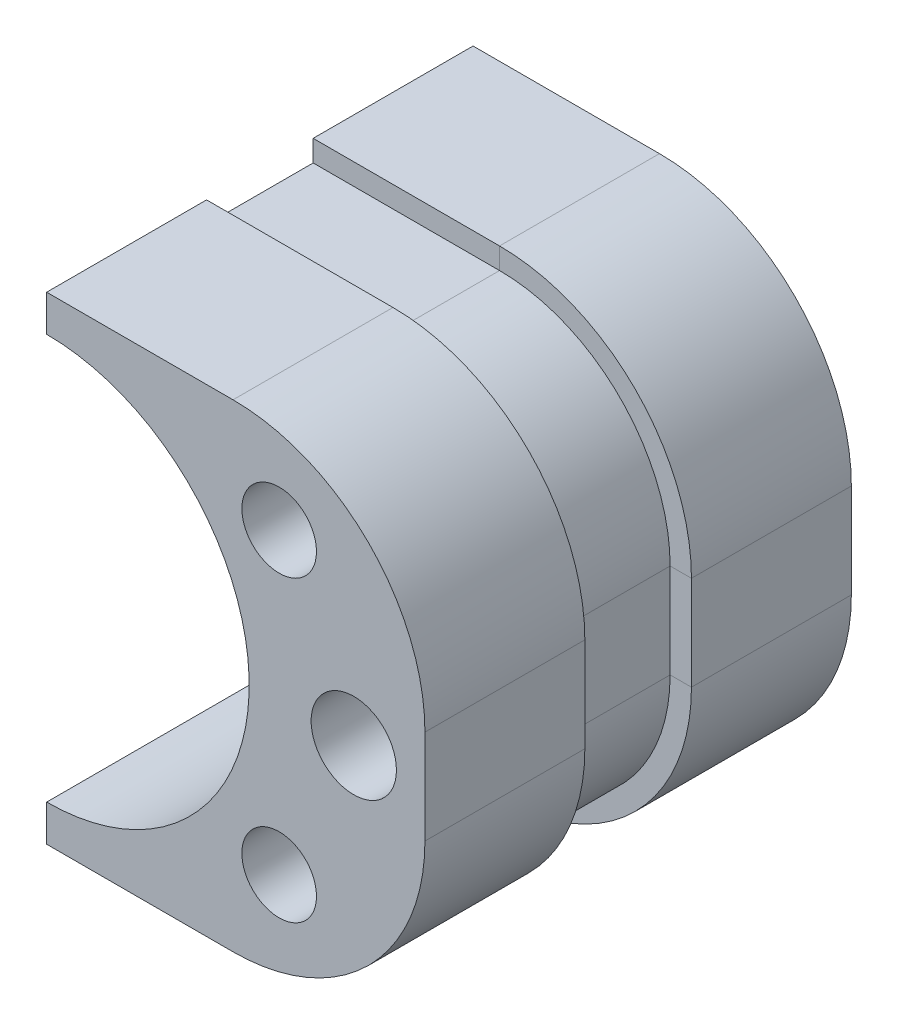
ISO-10303-21;
HEADER;
FILE_DESCRIPTION(('STEP AP214'),'2;1');
FILE_NAME('part.step','',(''),(''),'','','');
FILE_SCHEMA(('AUTOMOTIVE_DESIGN { 1 0 10303 214 1 1 1 1 }'));
ENDSEC;
DATA;
#1=APPLICATION_CONTEXT('core data for automotive mechanical design processes');
#2=APPLICATION_PROTOCOL_DEFINITION('international standard','automotive_design',2000,#1);
#3=PRODUCT_CONTEXT('',#1,'mechanical');
#4=PRODUCT('Part','Part','',(#3));
#5=PRODUCT_RELATED_PRODUCT_CATEGORY('part','',(#4));
#6=PRODUCT_DEFINITION_FORMATION('','',#4);
#7=PRODUCT_DEFINITION_CONTEXT('part definition',#1,'design');
#8=PRODUCT_DEFINITION('design','',#6,#7);
#9=PRODUCT_DEFINITION_SHAPE('','',#8);
#10=(LENGTH_UNIT() NAMED_UNIT(*) SI_UNIT(.MILLI.,.METRE.));
#11=(NAMED_UNIT(*) PLANE_ANGLE_UNIT() SI_UNIT($,.RADIAN.));
#12=(NAMED_UNIT(*) SI_UNIT($,.STERADIAN.) SOLID_ANGLE_UNIT());
#13=UNCERTAINTY_MEASURE_WITH_UNIT(LENGTH_MEASURE(1.E-05),#10,'distance_accuracy_value','');
#14=(GEOMETRIC_REPRESENTATION_CONTEXT(3) GLOBAL_UNCERTAINTY_ASSIGNED_CONTEXT((#13)) GLOBAL_UNIT_ASSIGNED_CONTEXT((#10,
#11,#12)) REPRESENTATION_CONTEXT('',''));
#15=CARTESIAN_POINT('',(0.,0.,0.));
#16=DIRECTION('',(0.,0.,1.));
#17=DIRECTION('',(1.,0.,0.));
#18=AXIS2_PLACEMENT_3D('',#15,#16,#17);
#19=CARTESIAN_POINT('',(21.9231967996094,14.,40.));
#20=DIRECTION('',(0.,0.,-1.));
#21=DIRECTION('',(-1.,0.,0.));
#22=AXIS2_PLACEMENT_3D('',#19,#20,#21);
#23=CYLINDRICAL_SURFACE('',#22,1.39305345916474);
#24=CARTESIAN_POINT('',(21.9231967996094,14.,0.));
#25=DIRECTION('',(0.,0.,1.));
#26=DIRECTION('',(1.,0.,0.));
#27=AXIS2_PLACEMENT_3D('',#24,#25,#26);
#28=CIRCLE('',#27,1.39305345916474);
#29=CARTESIAN_POINT('',(23.3162502587742,14.,0.));
#30=VERTEX_POINT('',#29);
#31=EDGE_CURVE('E150',#30,#30,#28,.T.);
#32=ORIENTED_EDGE('',*,*,#31,.F.);
#33=EDGE_LOOP('',(#32));
#34=FACE_BOUND('',#33,.T.);
#35=CARTESIAN_POINT('',(21.9231967996094,14.,30.));
#36=DIRECTION('',(0.,0.,1.));
#37=DIRECTION('',(1.,0.,0.));
#38=AXIS2_PLACEMENT_3D('',#35,#36,#37);
#39=CIRCLE('',#38,1.39305345916474);
#40=CARTESIAN_POINT('',(23.3162502587742,14.,30.));
#41=VERTEX_POINT('',#40);
#42=EDGE_CURVE('E38',#41,#41,#39,.T.);
#43=ORIENTED_EDGE('',*,*,#42,.T.);
#44=EDGE_LOOP('',(#43));
#45=FACE_BOUND('',#44,.T.);
#46=ADVANCED_FACE('F34',(#34,#45),#23,.F.);
#47=CARTESIAN_POINT('',(21.9231967996094,-14.,40.));
#48=DIRECTION('',(0.,0.,-1.));
#49=DIRECTION('',(-1.,0.,0.));
#50=AXIS2_PLACEMENT_3D('',#47,#48,#49);
#51=CYLINDRICAL_SURFACE('',#50,1.39305345916474);
#52=CARTESIAN_POINT('',(21.9231967996094,-14.,0.));
#53=DIRECTION('',(0.,0.,1.));
#54=DIRECTION('',(1.,0.,0.));
#55=AXIS2_PLACEMENT_3D('',#52,#53,#54);
#56=CIRCLE('',#55,1.39305345916474);
#57=CARTESIAN_POINT('',(23.3162502587742,-14.,0.));
#58=VERTEX_POINT('',#57);
#59=EDGE_CURVE('E177',#58,#58,#56,.F.);
#60=ORIENTED_EDGE('',*,*,#59,.T.);
#61=EDGE_LOOP('',(#60));
#62=FACE_BOUND('',#61,.T.);
#63=CARTESIAN_POINT('',(21.9231967996094,-14.,30.));
#64=DIRECTION('',(0.,0.,1.));
#65=DIRECTION('',(1.,0.,0.));
#66=AXIS2_PLACEMENT_3D('',#63,#64,#65);
#67=CIRCLE('',#66,1.39305345916474);
#68=CARTESIAN_POINT('',(23.3162502587742,-14.,30.));
#69=VERTEX_POINT('',#68);
#70=EDGE_CURVE('E196',#69,#69,#67,.F.);
#71=ORIENTED_EDGE('',*,*,#70,.F.);
#72=EDGE_LOOP('',(#71));
#73=FACE_BOUND('',#72,.T.);
#74=ADVANCED_FACE('F480',(#62,#73),#51,.F.);
#75=CARTESIAN_POINT('',(0.,-22.4238776717364,40.));
#76=DIRECTION('',(0.,1.,0.));
#77=DIRECTION('',(0.,0.,1.));
#78=AXIS2_PLACEMENT_3D('',#75,#76,#77);
#79=PLANE('',#78);
#80=DIRECTION('',(0.,0.,-1.));
#81=VECTOR('',#80,1.);
#82=CARTESIAN_POINT('',(17.5982085730052,-22.4238776717364,40.));
#83=LINE('',#82,#81);
#84=CARTESIAN_POINT('',(17.5982085730052,-22.4238776717364,15.));
#85=VERTEX_POINT('',#84);
#86=CARTESIAN_POINT('',(17.5982085730052,-22.4238776717364,0.));
#87=VERTEX_POINT('',#86);
#88=EDGE_CURVE('E190',#85,#87,#83,.T.);
#89=ORIENTED_EDGE('',*,*,#88,.F.);
#90=DIRECTION('',(1.,0.,0.));
#91=VECTOR('',#90,1.);
#92=CARTESIAN_POINT('',(-0.887437669269544,-22.4238776717364,15.));
#93=LINE('',#92,#91);
#94=CARTESIAN_POINT('',(0.112562330730456,-22.4238776717364,15.));
#95=VERTEX_POINT('',#94);
#96=EDGE_CURVE('E225',#95,#85,#93,.T.);
#97=ORIENTED_EDGE('',*,*,#96,.F.);
#98=DIRECTION('',(0.,0.,-1.));
#99=VECTOR('',#98,1.);
#100=CARTESIAN_POINT('',(0.112562330730456,-22.4238776717364,40.));
#101=LINE('',#100,#99);
#102=CARTESIAN_POINT('',(0.112562330730456,-22.4238776717364,0.));
#103=VERTEX_POINT('',#102);
#104=EDGE_CURVE('E194',#95,#103,#101,.T.);
#105=ORIENTED_EDGE('',*,*,#104,.T.);
#106=DIRECTION('',(1.,0.,0.));
#107=VECTOR('',#106,1.);
#108=CARTESIAN_POINT('',(0.,-22.4238776717364,0.));
#109=LINE('',#108,#107);
#110=EDGE_CURVE('E159',#103,#87,#109,.T.);
#111=ORIENTED_EDGE('',*,*,#110,.T.);
#112=EDGE_LOOP('',(#89,#97,#105,#111));
#113=FACE_BOUND('',#112,.T.);
#114=ADVANCED_FACE('F430',(#113),#79,.F.);
#115=CARTESIAN_POINT('',(17.5982085730052,-4.42387767173636,40.));
#116=DIRECTION('',(0.,0.,-1.));
#117=DIRECTION('',(-1.,0.,0.));
#118=AXIS2_PLACEMENT_3D('',#115,#116,#117);
#119=CYLINDRICAL_SURFACE('',#118,18.);
#120=CARTESIAN_POINT('',(17.5982085730052,-4.42387767173636,15.));
#121=DIRECTION('',(0.,0.,1.));
#122=DIRECTION('',(0.,-1.,0.));
#123=AXIS2_PLACEMENT_3D('',#120,#121,#122);
#124=CIRCLE('',#123,18.);
#125=CARTESIAN_POINT('',(35.5982085730052,-4.42387767173636,15.));
#126=VERTEX_POINT('',#125);
#127=EDGE_CURVE('E250',#85,#126,#124,.T.);
#128=ORIENTED_EDGE('',*,*,#127,.F.);
#129=ORIENTED_EDGE('',*,*,#88,.T.);
#130=CARTESIAN_POINT('',(17.5982085730052,-4.42387767173636,0.));
#131=DIRECTION('',(0.,0.,1.));
#132=DIRECTION('',(1.,0.,0.));
#133=AXIS2_PLACEMENT_3D('',#130,#131,#132);
#134=CIRCLE('',#133,18.);
#135=CARTESIAN_POINT('',(35.5982085730052,-4.42387767173635,0.));
#136=VERTEX_POINT('',#135);
#137=EDGE_CURVE('E162',#136,#87,#134,.F.);
#138=ORIENTED_EDGE('',*,*,#137,.F.);
#139=DIRECTION('',(0.,0.,-1.));
#140=VECTOR('',#139,1.);
#141=CARTESIAN_POINT('',(35.5982085730052,-4.42387767173635,40.));
#142=LINE('',#141,#140);
#143=EDGE_CURVE('E186',#126,#136,#142,.T.);
#144=ORIENTED_EDGE('',*,*,#143,.F.);
#145=EDGE_LOOP('',(#128,#129,#138,#144));
#146=FACE_BOUND('',#145,.T.);
#147=ADVANCED_FACE('F427',(#146),#119,.T.);
#148=CARTESIAN_POINT('',(35.5982085730052,0.,40.));
#149=DIRECTION('',(1.,0.,0.));
#150=DIRECTION('',(0.,0.,-1.));
#151=AXIS2_PLACEMENT_3D('',#148,#149,#150);
#152=PLANE('',#151);
#153=DIRECTION('',(0.,1.,0.));
#154=VECTOR('',#153,1.);
#155=CARTESIAN_POINT('',(35.5982085730052,-4.42387767173636,15.));
#156=LINE('',#155,#154);
#157=CARTESIAN_POINT('',(35.5982085730052,4.42387767173636,15.));
#158=VERTEX_POINT('',#157);
#159=EDGE_CURVE('E261',#126,#158,#156,.T.);
#160=ORIENTED_EDGE('',*,*,#159,.F.);
#161=ORIENTED_EDGE('',*,*,#143,.T.);
#162=DIRECTION('',(0.,-1.,0.));
#163=VECTOR('',#162,1.);
#164=CARTESIAN_POINT('',(35.5982085730052,0.,0.));
#165=LINE('',#164,#163);
#166=CARTESIAN_POINT('',(35.5982085730052,4.42387767173636,0.));
#167=VERTEX_POINT('',#166);
#168=EDGE_CURVE('E165',#167,#136,#165,.T.);
#169=ORIENTED_EDGE('',*,*,#168,.F.);
#170=DIRECTION('',(0.,0.,-1.));
#171=VECTOR('',#170,1.);
#172=CARTESIAN_POINT('',(35.5982085730052,4.42387767173636,40.));
#173=LINE('',#172,#171);
#174=EDGE_CURVE('E126',#158,#167,#173,.T.);
#175=ORIENTED_EDGE('',*,*,#174,.F.);
#176=EDGE_LOOP('',(#160,#161,#169,#175));
#177=FACE_BOUND('',#176,.T.);
#178=ADVANCED_FACE('F439',(#177),#152,.T.);
#179=CARTESIAN_POINT('',(17.5982085730052,4.42387767173636,40.));
#180=DIRECTION('',(0.,0.,-1.));
#181=DIRECTION('',(-1.,0.,0.));
#182=AXIS2_PLACEMENT_3D('',#179,#180,#181);
#183=CYLINDRICAL_SURFACE('',#182,18.);
#184=CARTESIAN_POINT('',(17.5982085730052,4.42387767173636,15.));
#185=DIRECTION('',(0.,0.,1.));
#186=DIRECTION('',(1.,0.,0.));
#187=AXIS2_PLACEMENT_3D('',#184,#185,#186);
#188=CIRCLE('',#187,18.);
#189=CARTESIAN_POINT('',(17.5982085730052,22.4238776717364,15.));
#190=VERTEX_POINT('',#189);
#191=EDGE_CURVE('E151',#158,#190,#188,.T.);
#192=ORIENTED_EDGE('',*,*,#191,.F.);
#193=ORIENTED_EDGE('',*,*,#174,.T.);
#194=CARTESIAN_POINT('',(17.5982085730052,4.42387767173636,0.));
#195=DIRECTION('',(0.,0.,1.));
#196=DIRECTION('',(1.,0.,0.));
#197=AXIS2_PLACEMENT_3D('',#194,#195,#196);
#198=CIRCLE('',#197,18.);
#199=CARTESIAN_POINT('',(17.5982085730052,22.4238776717364,0.));
#200=VERTEX_POINT('',#199);
#201=EDGE_CURVE('E168',#200,#167,#198,.F.);
#202=ORIENTED_EDGE('',*,*,#201,.F.);
#203=DIRECTION('',(0.,0.,-1.));
#204=VECTOR('',#203,1.);
#205=CARTESIAN_POINT('',(17.5982085730052,22.4238776717364,40.));
#206=LINE('',#205,#204);
#207=EDGE_CURVE('E127',#190,#200,#206,.T.);
#208=ORIENTED_EDGE('',*,*,#207,.F.);
#209=EDGE_LOOP('',(#192,#193,#202,#208));
#210=FACE_BOUND('',#209,.T.);
#211=ADVANCED_FACE('F445',(#210),#183,.T.);
#212=CARTESIAN_POINT('',(0.,22.4238776717364,40.));
#213=DIRECTION('',(0.,1.,0.));
#214=DIRECTION('',(0.,0.,1.));
#215=AXIS2_PLACEMENT_3D('',#212,#213,#214);
#216=PLANE('',#215);
#217=DIRECTION('',(-1.,0.,0.));
#218=VECTOR('',#217,1.);
#219=CARTESIAN_POINT('',(17.5982085730052,22.4238776717364,15.));
#220=LINE('',#219,#218);
#221=CARTESIAN_POINT('',(0.112562330730457,22.4238776717364,15.));
#222=VERTEX_POINT('',#221);
#223=EDGE_CURVE('E216',#190,#222,#220,.T.);
#224=ORIENTED_EDGE('',*,*,#223,.F.);
#225=ORIENTED_EDGE('',*,*,#207,.T.);
#226=DIRECTION('',(1.,0.,0.));
#227=VECTOR('',#226,1.);
#228=CARTESIAN_POINT('',(0.,22.4238776717364,0.));
#229=LINE('',#228,#227);
#230=CARTESIAN_POINT('',(0.112562330730456,22.4238776717364,0.));
#231=VERTEX_POINT('',#230);
#232=EDGE_CURVE('E171',#231,#200,#229,.T.);
#233=ORIENTED_EDGE('',*,*,#232,.F.);
#234=DIRECTION('',(0.,0.,-1.));
#235=VECTOR('',#234,1.);
#236=CARTESIAN_POINT('',(0.112562330730456,22.4238776717364,40.));
#237=LINE('',#236,#235);
#238=EDGE_CURVE('E182',#222,#231,#237,.T.);
#239=ORIENTED_EDGE('',*,*,#238,.F.);
#240=EDGE_LOOP('',(#224,#225,#233,#239));
#241=FACE_BOUND('',#240,.T.);
#242=ADVANCED_FACE('F451',(#241),#216,.T.);
#243=CARTESIAN_POINT('',(0.112562330730456,0.,40.));
#244=DIRECTION('',(0.,0.,-1.));
#245=DIRECTION('',(-1.,0.,0.));
#246=AXIS2_PLACEMENT_3D('',#243,#244,#245);
#247=CYLINDRICAL_SURFACE('',#246,19.);
#248=CARTESIAN_POINT('',(0.112562330730456,0.,0.));
#249=DIRECTION('',(0.,0.,1.));
#250=DIRECTION('',(1.,0.,0.));
#251=AXIS2_PLACEMENT_3D('',#248,#249,#250);
#252=CIRCLE('',#251,19.);
#253=CARTESIAN_POINT('',(0.112562330730456,-19.,0.));
#254=VERTEX_POINT('',#253);
#255=CARTESIAN_POINT('',(0.112562330730456,19.,0.));
#256=VERTEX_POINT('',#255);
#257=EDGE_CURVE('E154',#254,#256,#252,.T.);
#258=ORIENTED_EDGE('',*,*,#257,.F.);
#259=DIRECTION('',(0.,0.,-1.));
#260=VECTOR('',#259,1.);
#261=CARTESIAN_POINT('',(0.112562330730456,-19.,40.));
#262=LINE('',#261,#260);
#263=CARTESIAN_POINT('',(0.112562330730456,-19.,40.));
#264=VERTEX_POINT('',#263);
#265=EDGE_CURVE('E11',#264,#254,#262,.T.);
#266=ORIENTED_EDGE('',*,*,#265,.F.);
#267=CARTESIAN_POINT('',(0.112562330730456,0.,40.));
#268=DIRECTION('',(0.,0.,1.));
#269=DIRECTION('',(1.,0.,0.));
#270=AXIS2_PLACEMENT_3D('',#267,#268,#269);
#271=CIRCLE('',#270,19.);
#272=CARTESIAN_POINT('',(0.112562330730456,19.,40.));
#273=VERTEX_POINT('',#272);
#274=EDGE_CURVE('E322',#264,#273,#271,.T.);
#275=ORIENTED_EDGE('',*,*,#274,.T.);
#276=DIRECTION('',(0.,0.,-1.));
#277=VECTOR('',#276,1.);
#278=CARTESIAN_POINT('',(0.112562330730456,19.,40.));
#279=LINE('',#278,#277);
#280=EDGE_CURVE('E60',#273,#256,#279,.T.);
#281=ORIENTED_EDGE('',*,*,#280,.T.);
#282=EDGE_LOOP('',(#258,#266,#275,#281));
#283=FACE_BOUND('',#282,.T.);
#284=ADVANCED_FACE('F490',(#283),#247,.F.);
#285=CARTESIAN_POINT('',(0.112562330730456,0.,40.));
#286=DIRECTION('',(-1.,0.,0.));
#287=DIRECTION('',(0.,0.,1.));
#288=AXIS2_PLACEMENT_3D('',#285,#286,#287);
#289=PLANE('',#288);
#290=DIRECTION('',(0.,1.,0.));
#291=VECTOR('',#290,1.);
#292=CARTESIAN_POINT('',(0.112562330730456,-22.4238776717364,15.));
#293=LINE('',#292,#291);
#294=CARTESIAN_POINT('',(0.112562330730456,-20.4238776717364,15.));
#295=VERTEX_POINT('',#294);
#296=EDGE_CURVE('E198',#95,#295,#293,.T.);
#297=ORIENTED_EDGE('',*,*,#296,.T.);
#298=DIRECTION('',(0.,0.,1.));
#299=VECTOR('',#298,1.);
#300=CARTESIAN_POINT('',(0.112562330730456,-20.4238776717364,15.));
#301=LINE('',#300,#299);
#302=CARTESIAN_POINT('',(0.112562330730456,-20.4238776717364,25.));
#303=VERTEX_POINT('',#302);
#304=EDGE_CURVE('E304',#295,#303,#301,.T.);
#305=ORIENTED_EDGE('',*,*,#304,.T.);
#306=DIRECTION('',(0.,-1.,0.));
#307=VECTOR('',#306,1.);
#308=CARTESIAN_POINT('',(0.112562330730456,-22.4238776717364,25.));
#309=LINE('',#308,#307);
#310=CARTESIAN_POINT('',(0.112562330730456,-22.4238776717364,25.));
#311=VERTEX_POINT('',#310);
#312=EDGE_CURVE('E308',#303,#311,#309,.T.);
#313=ORIENTED_EDGE('',*,*,#312,.T.);
#314=CARTESIAN_POINT('',(0.112562330730456,-22.4238776717364,40.));
#315=VERTEX_POINT('',#314);
#316=EDGE_CURVE('E43',#315,#311,#101,.T.);
#317=ORIENTED_EDGE('',*,*,#316,.F.);
#318=DIRECTION('',(0.,1.,0.));
#319=VECTOR('',#318,1.);
#320=CARTESIAN_POINT('',(0.112562330730456,0.,40.));
#321=LINE('',#320,#319);
#322=EDGE_CURVE('E324',#315,#264,#321,.T.);
#323=ORIENTED_EDGE('',*,*,#322,.T.);
#324=ORIENTED_EDGE('',*,*,#265,.T.);
#325=DIRECTION('',(0.,1.,0.));
#326=VECTOR('',#325,1.);
#327=CARTESIAN_POINT('',(0.112562330730456,0.,0.));
#328=LINE('',#327,#326);
#329=EDGE_CURVE('E156',#103,#254,#328,.T.);
#330=ORIENTED_EDGE('',*,*,#329,.F.);
#331=ORIENTED_EDGE('',*,*,#104,.F.);
#332=EDGE_LOOP('',(#297,#305,#313,#317,#323,#324,#330,#331));
#333=FACE_BOUND('',#332,.T.);
#334=ADVANCED_FACE('F411',(#333),#289,.T.);
#335=ORIENTED_EDGE('',*,*,#316,.T.);
#336=DIRECTION('',(1.,0.,0.));
#337=VECTOR('',#336,1.);
#338=CARTESIAN_POINT('',(-0.887437669269544,-22.4238776717364,25.));
#339=LINE('',#338,#337);
#340=CARTESIAN_POINT('',(17.5982085730052,-22.4238776717364,25.));
#341=VERTEX_POINT('',#340);
#342=EDGE_CURVE('E311',#311,#341,#339,.T.);
#343=ORIENTED_EDGE('',*,*,#342,.T.);
#344=CARTESIAN_POINT('',(17.5982085730052,-22.4238776717364,40.));
#345=VERTEX_POINT('',#344);
#346=EDGE_CURVE('E191',#345,#341,#83,.T.);
#347=ORIENTED_EDGE('',*,*,#346,.F.);
#348=DIRECTION('',(1.,0.,0.));
#349=VECTOR('',#348,1.);
#350=CARTESIAN_POINT('',(0.,-22.4238776717364,40.));
#351=LINE('',#350,#349);
#352=EDGE_CURVE('E327',#315,#345,#351,.T.);
#353=ORIENTED_EDGE('',*,*,#352,.F.);
#354=EDGE_LOOP('',(#335,#343,#347,#353));
#355=FACE_BOUND('',#354,.T.);
#356=ADVANCED_FACE('F406',(#355),#79,.F.);
#357=CARTESIAN_POINT('',(17.5982085730052,-4.42387767173636,25.));
#358=DIRECTION('',(0.,0.,1.));
#359=DIRECTION('',(0.,-1.,0.));
#360=AXIS2_PLACEMENT_3D('',#357,#358,#359);
#361=CIRCLE('',#360,18.);
#362=CARTESIAN_POINT('',(35.5982085730052,-4.42387767173636,25.));
#363=VERTEX_POINT('',#362);
#364=EDGE_CURVE('E275',#341,#363,#361,.T.);
#365=ORIENTED_EDGE('',*,*,#364,.T.);
#366=CARTESIAN_POINT('',(35.5982085730052,-4.42387767173635,40.));
#367=VERTEX_POINT('',#366);
#368=EDGE_CURVE('E187',#367,#363,#142,.T.);
#369=ORIENTED_EDGE('',*,*,#368,.F.);
#370=CARTESIAN_POINT('',(17.5982085730052,-4.42387767173636,40.));
#371=DIRECTION('',(0.,0.,1.));
#372=DIRECTION('',(1.,0.,0.));
#373=AXIS2_PLACEMENT_3D('',#370,#371,#372);
#374=CIRCLE('',#373,18.);
#375=EDGE_CURVE('E329',#367,#345,#374,.F.);
#376=ORIENTED_EDGE('',*,*,#375,.T.);
#377=ORIENTED_EDGE('',*,*,#346,.T.);
#378=EDGE_LOOP('',(#365,#369,#376,#377));
#379=FACE_BOUND('',#378,.T.);
#380=ADVANCED_FACE('F408',(#379),#119,.T.);
#381=DIRECTION('',(0.,1.,0.));
#382=VECTOR('',#381,1.);
#383=CARTESIAN_POINT('',(35.5982085730052,-4.42387767173636,25.));
#384=LINE('',#383,#382);
#385=CARTESIAN_POINT('',(35.5982085730052,4.42387767173636,25.));
#386=VERTEX_POINT('',#385);
#387=EDGE_CURVE('E279',#363,#386,#384,.T.);
#388=ORIENTED_EDGE('',*,*,#387,.T.);
#389=CARTESIAN_POINT('',(35.5982085730052,4.42387767173636,40.));
#390=VERTEX_POINT('',#389);
#391=EDGE_CURVE('E184',#390,#386,#173,.T.);
#392=ORIENTED_EDGE('',*,*,#391,.F.);
#393=DIRECTION('',(0.,-1.,0.));
#394=VECTOR('',#393,1.);
#395=CARTESIAN_POINT('',(35.5982085730052,0.,40.));
#396=LINE('',#395,#394);
#397=EDGE_CURVE('E137',#390,#367,#396,.T.);
#398=ORIENTED_EDGE('',*,*,#397,.T.);
#399=ORIENTED_EDGE('',*,*,#368,.T.);
#400=EDGE_LOOP('',(#388,#392,#398,#399));
#401=FACE_BOUND('',#400,.T.);
#402=ADVANCED_FACE('F332',(#401),#152,.T.);
#403=CARTESIAN_POINT('',(17.5982085730052,4.42387767173636,25.));
#404=DIRECTION('',(0.,0.,1.));
#405=DIRECTION('',(1.,0.,0.));
#406=AXIS2_PLACEMENT_3D('',#403,#404,#405);
#407=CIRCLE('',#406,18.);
#408=CARTESIAN_POINT('',(17.5982085730052,22.4238776717364,25.));
#409=VERTEX_POINT('',#408);
#410=EDGE_CURVE('E122',#386,#409,#407,.T.);
#411=ORIENTED_EDGE('',*,*,#410,.T.);
#412=CARTESIAN_POINT('',(17.5982085730052,22.4238776717364,40.));
#413=VERTEX_POINT('',#412);
#414=EDGE_CURVE('E115',#413,#409,#206,.T.);
#415=ORIENTED_EDGE('',*,*,#414,.F.);
#416=CARTESIAN_POINT('',(17.5982085730052,4.42387767173636,40.));
#417=DIRECTION('',(0.,0.,1.));
#418=DIRECTION('',(1.,0.,0.));
#419=AXIS2_PLACEMENT_3D('',#416,#417,#418);
#420=CIRCLE('',#419,18.);
#421=EDGE_CURVE('E119',#413,#390,#420,.F.);
#422=ORIENTED_EDGE('',*,*,#421,.T.);
#423=ORIENTED_EDGE('',*,*,#391,.T.);
#424=EDGE_LOOP('',(#411,#415,#422,#423));
#425=FACE_BOUND('',#424,.T.);
#426=ADVANCED_FACE('F117',(#425),#183,.T.);
#427=DIRECTION('',(-1.,0.,0.));
#428=VECTOR('',#427,1.);
#429=CARTESIAN_POINT('',(17.5982085730052,22.4238776717364,25.));
#430=LINE('',#429,#428);
#431=CARTESIAN_POINT('',(0.112562330730457,22.4238776717364,25.));
#432=VERTEX_POINT('',#431);
#433=EDGE_CURVE('E229',#409,#432,#430,.T.);
#434=ORIENTED_EDGE('',*,*,#433,.T.);
#435=CARTESIAN_POINT('',(0.112562330730456,22.4238776717364,40.));
#436=VERTEX_POINT('',#435);
#437=EDGE_CURVE('E141',#436,#432,#237,.T.);
#438=ORIENTED_EDGE('',*,*,#437,.F.);
#439=DIRECTION('',(1.,0.,0.));
#440=VECTOR('',#439,1.);
#441=CARTESIAN_POINT('',(0.,22.4238776717364,40.));
#442=LINE('',#441,#440);
#443=EDGE_CURVE('E134',#436,#413,#442,.T.);
#444=ORIENTED_EDGE('',*,*,#443,.T.);
#445=ORIENTED_EDGE('',*,*,#414,.T.);
#446=EDGE_LOOP('',(#434,#438,#444,#445));
#447=FACE_BOUND('',#446,.T.);
#448=ADVANCED_FACE('F139',(#447),#216,.T.);
#449=CARTESIAN_POINT('',(0.112562330730456,0.,40.));
#450=DIRECTION('',(-1.,0.,0.));
#451=DIRECTION('',(0.,0.,1.));
#452=AXIS2_PLACEMENT_3D('',#449,#450,#451);
#453=PLANE('',#452);
#454=DIRECTION('',(0.,1.,0.));
#455=VECTOR('',#454,1.);
#456=CARTESIAN_POINT('',(0.112562330730457,22.4238776717364,15.));
#457=LINE('',#456,#455);
#458=CARTESIAN_POINT('',(0.112562330730457,20.4238776717364,15.));
#459=VERTEX_POINT('',#458);
#460=EDGE_CURVE('E224',#459,#222,#457,.T.);
#461=ORIENTED_EDGE('',*,*,#460,.T.);
#462=ORIENTED_EDGE('',*,*,#238,.T.);
#463=DIRECTION('',(0.,1.,0.));
#464=VECTOR('',#463,1.);
#465=CARTESIAN_POINT('',(0.112562330730456,0.,0.));
#466=LINE('',#465,#464);
#467=EDGE_CURVE('E174',#256,#231,#466,.T.);
#468=ORIENTED_EDGE('',*,*,#467,.F.);
#469=ORIENTED_EDGE('',*,*,#280,.F.);
#470=DIRECTION('',(0.,1.,0.));
#471=VECTOR('',#470,1.);
#472=CARTESIAN_POINT('',(0.112562330730456,0.,40.));
#473=LINE('',#472,#471);
#474=EDGE_CURVE('E142',#273,#436,#473,.T.);
#475=ORIENTED_EDGE('',*,*,#474,.T.);
#476=ORIENTED_EDGE('',*,*,#437,.T.);
#477=DIRECTION('',(0.,-1.,0.));
#478=VECTOR('',#477,1.);
#479=CARTESIAN_POINT('',(0.112562330730457,22.4238776717364,25.));
#480=LINE('',#479,#478);
#481=CARTESIAN_POINT('',(0.112562330730456,20.4238776717364,25.));
#482=VERTEX_POINT('',#481);
#483=EDGE_CURVE('E231',#432,#482,#480,.T.);
#484=ORIENTED_EDGE('',*,*,#483,.T.);
#485=DIRECTION('',(0.,0.,-1.));
#486=VECTOR('',#485,1.);
#487=CARTESIAN_POINT('',(0.112562330730457,20.4238776717364,15.));
#488=LINE('',#487,#486);
#489=EDGE_CURVE('E227',#482,#459,#488,.T.);
#490=ORIENTED_EDGE('',*,*,#489,.T.);
#491=EDGE_LOOP('',(#461,#462,#468,#469,#475,#476,#484,#490));
#492=FACE_BOUND('',#491,.T.);
#493=ADVANCED_FACE('F455',(#492),#453,.T.);
#494=CARTESIAN_POINT('',(28.9231967996094,0.,40.));
#495=DIRECTION('',(0.,0.,-1.));
#496=DIRECTION('',(-1.,0.,0.));
#497=AXIS2_PLACEMENT_3D('',#494,#495,#496);
#498=CYLINDRICAL_SURFACE('',#497,4.00000000000001);
#499=CARTESIAN_POINT('',(28.9231967996094,0.,40.));
#500=DIRECTION('',(0.,0.,1.));
#501=DIRECTION('',(1.,0.,0.));
#502=AXIS2_PLACEMENT_3D('',#499,#500,#501);
#503=CIRCLE('',#502,4.00000000000001);
#504=CARTESIAN_POINT('',(32.9231967996094,0.,40.));
#505=VERTEX_POINT('',#504);
#506=EDGE_CURVE('E180',#505,#505,#503,.T.);
#507=ORIENTED_EDGE('',*,*,#506,.T.);
#508=EDGE_LOOP('',(#507));
#509=FACE_BOUND('',#508,.T.);
#510=CARTESIAN_POINT('',(28.9231967996094,0.,0.));
#511=DIRECTION('',(0.,0.,1.));
#512=DIRECTION('',(1.,0.,0.));
#513=AXIS2_PLACEMENT_3D('',#510,#511,#512);
#514=CIRCLE('',#513,4.00000000000001);
#515=CARTESIAN_POINT('',(32.9231967996094,0.,0.));
#516=VERTEX_POINT('',#515);
#517=EDGE_CURVE('E147',#516,#516,#514,.T.);
#518=ORIENTED_EDGE('',*,*,#517,.F.);
#519=EDGE_LOOP('',(#518));
#520=FACE_BOUND('',#519,.T.);
#521=ADVANCED_FACE('F36',(#509,#520),#498,.F.);
#522=CARTESIAN_POINT('',(0.,0.,40.));
#523=DIRECTION('',(0.,0.,1.));
#524=DIRECTION('',(1.,0.,0.));
#525=AXIS2_PLACEMENT_3D('',#522,#523,#524);
#526=PLANE('',#525);
#527=CARTESIAN_POINT('',(21.9231967996094,14.,40.));
#528=DIRECTION('',(0.,0.,1.));
#529=DIRECTION('',(1.,0.,0.));
#530=AXIS2_PLACEMENT_3D('',#527,#528,#529);
#531=CIRCLE('',#530,3.5);
#532=CARTESIAN_POINT('',(25.4231967996094,14.,40.));
#533=VERTEX_POINT('',#532);
#534=EDGE_CURVE('E213',#533,#533,#531,.T.);
#535=ORIENTED_EDGE('',*,*,#534,.F.);
#536=EDGE_LOOP('',(#535));
#537=FACE_BOUND('',#536,.T.);
#538=CARTESIAN_POINT('',(21.9231967996094,-14.,40.));
#539=DIRECTION('',(0.,0.,1.));
#540=DIRECTION('',(1.,0.,0.));
#541=AXIS2_PLACEMENT_3D('',#538,#539,#540);
#542=CIRCLE('',#541,3.5);
#543=CARTESIAN_POINT('',(25.4231967996094,-14.,40.));
#544=VERTEX_POINT('',#543);
#545=EDGE_CURVE('E206',#544,#544,#542,.T.);
#546=ORIENTED_EDGE('',*,*,#545,.F.);
#547=EDGE_LOOP('',(#546));
#548=FACE_BOUND('',#547,.T.);
#549=ORIENTED_EDGE('',*,*,#506,.F.);
#550=EDGE_LOOP('',(#549));
#551=FACE_BOUND('',#550,.T.);
#552=ORIENTED_EDGE('',*,*,#274,.F.);
#553=ORIENTED_EDGE('',*,*,#322,.F.);
#554=ORIENTED_EDGE('',*,*,#352,.T.);
#555=ORIENTED_EDGE('',*,*,#375,.F.);
#556=ORIENTED_EDGE('',*,*,#397,.F.);
#557=ORIENTED_EDGE('',*,*,#421,.F.);
#558=ORIENTED_EDGE('',*,*,#443,.F.);
#559=ORIENTED_EDGE('',*,*,#474,.F.);
#560=EDGE_LOOP('',(#552,#553,#554,#555,#556,#557,#558,#559));
#561=FACE_BOUND('',#560,.T.);
#562=ADVANCED_FACE('F132',(#537,#548,#551,#561),#526,.T.);
#563=CARTESIAN_POINT('',(0.,0.,0.));
#564=DIRECTION('',(0.,0.,1.));
#565=DIRECTION('',(1.,0.,0.));
#566=AXIS2_PLACEMENT_3D('',#563,#564,#565);
#567=PLANE('',#566);
#568=ORIENTED_EDGE('',*,*,#517,.T.);
#569=EDGE_LOOP('',(#568));
#570=FACE_BOUND('',#569,.T.);
#571=ORIENTED_EDGE('',*,*,#31,.T.);
#572=EDGE_LOOP('',(#571));
#573=FACE_BOUND('',#572,.T.);
#574=ORIENTED_EDGE('',*,*,#257,.T.);
#575=ORIENTED_EDGE('',*,*,#467,.T.);
#576=ORIENTED_EDGE('',*,*,#232,.T.);
#577=ORIENTED_EDGE('',*,*,#201,.T.);
#578=ORIENTED_EDGE('',*,*,#168,.T.);
#579=ORIENTED_EDGE('',*,*,#137,.T.);
#580=ORIENTED_EDGE('',*,*,#110,.F.);
#581=ORIENTED_EDGE('',*,*,#329,.T.);
#582=EDGE_LOOP('',(#574,#575,#576,#577,#578,#579,#580,#581));
#583=FACE_BOUND('',#582,.T.);
#584=ORIENTED_EDGE('',*,*,#59,.F.);
#585=EDGE_LOOP('',(#584));
#586=FACE_BOUND('',#585,.T.);
#587=ADVANCED_FACE('F433',(#570,#573,#583,#586),#567,.F.);
#588=CARTESIAN_POINT('',(-0.887437669269544,-22.4238776717364,15.));
#589=DIRECTION('',(0.,0.,-1.));
#590=DIRECTION('',(-1.,0.,0.));
#591=AXIS2_PLACEMENT_3D('',#588,#589,#590);
#592=PLANE('',#591);
#593=ORIENTED_EDGE('',*,*,#96,.T.);
#594=DIRECTION('',(0.,1.,0.));
#595=VECTOR('',#594,1.);
#596=CARTESIAN_POINT('',(17.5982085730052,-22.4238776717364,15.));
#597=LINE('',#596,#595);
#598=CARTESIAN_POINT('',(17.5982085730052,-20.4238776717364,15.));
#599=VERTEX_POINT('',#598);
#600=EDGE_CURVE('E239',#85,#599,#597,.T.);
#601=ORIENTED_EDGE('',*,*,#600,.T.);
#602=DIRECTION('',(1.,0.,0.));
#603=VECTOR('',#602,1.);
#604=CARTESIAN_POINT('',(-0.887437669269544,-20.4238776717364,15.));
#605=LINE('',#604,#603);
#606=EDGE_CURVE('E203',#295,#599,#605,.T.);
#607=ORIENTED_EDGE('',*,*,#606,.F.);
#608=ORIENTED_EDGE('',*,*,#296,.F.);
#609=EDGE_LOOP('',(#593,#601,#607,#608));
#610=FACE_BOUND('',#609,.T.);
#611=ADVANCED_FACE('F417',(#610),#592,.F.);
#612=CARTESIAN_POINT('',(-0.887437669269544,-20.4238776717364,15.));
#613=DIRECTION('',(0.,1.,0.));
#614=DIRECTION('',(0.,0.,1.));
#615=AXIS2_PLACEMENT_3D('',#612,#613,#614);
#616=PLANE('',#615);
#617=ORIENTED_EDGE('',*,*,#606,.T.);
#618=DIRECTION('',(0.,0.,1.));
#619=VECTOR('',#618,1.);
#620=CARTESIAN_POINT('',(17.5982085730052,-20.4238776717364,15.));
#621=LINE('',#620,#619);
#622=CARTESIAN_POINT('',(17.5982085730052,-20.4238776717364,25.));
#623=VERTEX_POINT('',#622);
#624=EDGE_CURVE('E272',#599,#623,#621,.T.);
#625=ORIENTED_EDGE('',*,*,#624,.T.);
#626=DIRECTION('',(1.,0.,0.));
#627=VECTOR('',#626,1.);
#628=CARTESIAN_POINT('',(-0.887437669269544,-20.4238776717364,25.));
#629=LINE('',#628,#627);
#630=EDGE_CURVE('E307',#303,#623,#629,.T.);
#631=ORIENTED_EDGE('',*,*,#630,.F.);
#632=ORIENTED_EDGE('',*,*,#304,.F.);
#633=EDGE_LOOP('',(#617,#625,#631,#632));
#634=FACE_BOUND('',#633,.T.);
#635=ADVANCED_FACE('F415',(#634),#616,.F.);
#636=CARTESIAN_POINT('',(-0.887437669269544,-22.4238776717364,25.));
#637=DIRECTION('',(0.,0.,1.));
#638=DIRECTION('',(1.,0.,0.));
#639=AXIS2_PLACEMENT_3D('',#636,#637,#638);
#640=PLANE('',#639);
#641=ORIENTED_EDGE('',*,*,#630,.T.);
#642=DIRECTION('',(0.,-1.,0.));
#643=VECTOR('',#642,1.);
#644=CARTESIAN_POINT('',(17.5982085730052,-22.4238776717364,25.));
#645=LINE('',#644,#643);
#646=EDGE_CURVE('E253',#623,#341,#645,.T.);
#647=ORIENTED_EDGE('',*,*,#646,.T.);
#648=ORIENTED_EDGE('',*,*,#342,.F.);
#649=ORIENTED_EDGE('',*,*,#312,.F.);
#650=EDGE_LOOP('',(#641,#647,#648,#649));
#651=FACE_BOUND('',#650,.T.);
#652=ADVANCED_FACE('F402',(#651),#640,.F.);
#653=CARTESIAN_POINT('',(17.5982085730052,22.4238776717364,15.));
#654=DIRECTION('',(0.,0.,-1.));
#655=DIRECTION('',(-1.,0.,0.));
#656=AXIS2_PLACEMENT_3D('',#653,#654,#655);
#657=PLANE('',#656);
#658=DIRECTION('',(-1.,0.,0.));
#659=VECTOR('',#658,1.);
#660=CARTESIAN_POINT('',(17.5982085730052,20.4238776717364,15.));
#661=LINE('',#660,#659);
#662=CARTESIAN_POINT('',(17.5982085730052,20.4238776717364,15.));
#663=VERTEX_POINT('',#662);
#664=EDGE_CURVE('E221',#663,#459,#661,.T.);
#665=ORIENTED_EDGE('',*,*,#664,.F.);
#666=DIRECTION('',(0.,-1.,0.));
#667=VECTOR('',#666,1.);
#668=CARTESIAN_POINT('',(17.5982085730052,22.4238776717364,15.));
#669=LINE('',#668,#667);
#670=EDGE_CURVE('E228',#190,#663,#669,.T.);
#671=ORIENTED_EDGE('',*,*,#670,.F.);
#672=ORIENTED_EDGE('',*,*,#223,.T.);
#673=ORIENTED_EDGE('',*,*,#460,.F.);
#674=EDGE_LOOP('',(#665,#671,#672,#673));
#675=FACE_BOUND('',#674,.T.);
#676=ADVANCED_FACE('F454',(#675),#657,.F.);
#677=CARTESIAN_POINT('',(17.5982085730052,20.4238776717364,15.));
#678=DIRECTION('',(0.,-1.,0.));
#679=DIRECTION('',(0.,0.,-1.));
#680=AXIS2_PLACEMENT_3D('',#677,#678,#679);
#681=PLANE('',#680);
#682=DIRECTION('',(-1.,0.,0.));
#683=VECTOR('',#682,1.);
#684=CARTESIAN_POINT('',(17.5982085730052,20.4238776717364,25.));
#685=LINE('',#684,#683);
#686=CARTESIAN_POINT('',(17.5982085730052,20.4238776717364,25.));
#687=VERTEX_POINT('',#686);
#688=EDGE_CURVE('E51',#687,#482,#685,.T.);
#689=ORIENTED_EDGE('',*,*,#688,.F.);
#690=DIRECTION('',(0.,0.,1.));
#691=VECTOR('',#690,1.);
#692=CARTESIAN_POINT('',(17.5982085730052,20.4238776717364,15.));
#693=LINE('',#692,#691);
#694=EDGE_CURVE('E232',#663,#687,#693,.T.);
#695=ORIENTED_EDGE('',*,*,#694,.F.);
#696=ORIENTED_EDGE('',*,*,#664,.T.);
#697=ORIENTED_EDGE('',*,*,#489,.F.);
#698=EDGE_LOOP('',(#689,#695,#696,#697));
#699=FACE_BOUND('',#698,.T.);
#700=ADVANCED_FACE('F457',(#699),#681,.F.);
#701=CARTESIAN_POINT('',(17.5982085730052,22.4238776717364,25.));
#702=DIRECTION('',(0.,0.,1.));
#703=DIRECTION('',(1.,0.,0.));
#704=AXIS2_PLACEMENT_3D('',#701,#702,#703);
#705=PLANE('',#704);
#706=ORIENTED_EDGE('',*,*,#433,.F.);
#707=DIRECTION('',(0.,1.,0.));
#708=VECTOR('',#707,1.);
#709=CARTESIAN_POINT('',(17.5982085730052,22.4238776717364,25.));
#710=LINE('',#709,#708);
#711=EDGE_CURVE('E220',#687,#409,#710,.T.);
#712=ORIENTED_EDGE('',*,*,#711,.F.);
#713=ORIENTED_EDGE('',*,*,#688,.T.);
#714=ORIENTED_EDGE('',*,*,#483,.F.);
#715=EDGE_LOOP('',(#706,#712,#713,#714));
#716=FACE_BOUND('',#715,.T.);
#717=ADVANCED_FACE('F474',(#716),#705,.F.);
#718=CARTESIAN_POINT('',(17.5982085730052,-22.4238776717364,15.));
#719=DIRECTION('',(0.,0.,-1.));
#720=DIRECTION('',(-1.,0.,0.));
#721=AXIS2_PLACEMENT_3D('',#718,#719,#720);
#722=PLANE('',#721);
#723=CARTESIAN_POINT('',(17.5982085730052,-4.42387767173636,15.));
#724=DIRECTION('',(0.,0.,1.));
#725=DIRECTION('',(0.,-1.,0.));
#726=AXIS2_PLACEMENT_3D('',#723,#724,#725);
#727=CIRCLE('',#726,16.);
#728=CARTESIAN_POINT('',(33.5982085730052,-4.42387767173636,15.));
#729=VERTEX_POINT('',#728);
#730=EDGE_CURVE('E219',#599,#729,#727,.T.);
#731=ORIENTED_EDGE('',*,*,#730,.F.);
#732=ORIENTED_EDGE('',*,*,#600,.F.);
#733=ORIENTED_EDGE('',*,*,#127,.T.);
#734=DIRECTION('',(-1.,0.,0.));
#735=VECTOR('',#734,1.);
#736=CARTESIAN_POINT('',(35.5982085730052,-4.42387767173636,15.));
#737=LINE('',#736,#735);
#738=EDGE_CURVE('E243',#126,#729,#737,.T.);
#739=ORIENTED_EDGE('',*,*,#738,.T.);
#740=EDGE_LOOP('',(#731,#732,#733,#739));
#741=FACE_BOUND('',#740,.T.);
#742=ADVANCED_FACE('F421',(#741),#722,.F.);
#743=CARTESIAN_POINT('',(17.5982085730052,-4.42387767173636,40.));
#744=DIRECTION('',(0.,0.,1.));
#745=DIRECTION('',(1.,0.,0.));
#746=AXIS2_PLACEMENT_3D('',#743,#744,#745);
#747=CYLINDRICAL_SURFACE('',#746,16.);
#748=CARTESIAN_POINT('',(17.5982085730052,-4.42387767173636,25.));
#749=DIRECTION('',(0.,0.,1.));
#750=DIRECTION('',(0.,-1.,0.));
#751=AXIS2_PLACEMENT_3D('',#748,#749,#750);
#752=CIRCLE('',#751,16.);
#753=CARTESIAN_POINT('',(33.5982085730052,-4.42387767173636,25.));
#754=VERTEX_POINT('',#753);
#755=EDGE_CURVE('E242',#623,#754,#752,.T.);
#756=ORIENTED_EDGE('',*,*,#755,.F.);
#757=ORIENTED_EDGE('',*,*,#624,.F.);
#758=ORIENTED_EDGE('',*,*,#730,.T.);
#759=DIRECTION('',(0.,0.,1.));
#760=VECTOR('',#759,1.);
#761=CARTESIAN_POINT('',(33.5982085730052,-4.42387767173636,15.));
#762=LINE('',#761,#760);
#763=EDGE_CURVE('E276',#729,#754,#762,.T.);
#764=ORIENTED_EDGE('',*,*,#763,.T.);
#765=EDGE_LOOP('',(#756,#757,#758,#764));
#766=FACE_BOUND('',#765,.T.);
#767=ADVANCED_FACE('F466',(#766),#747,.T.);
#768=CARTESIAN_POINT('',(17.5982085730052,-22.4238776717364,25.));
#769=DIRECTION('',(0.,0.,1.));
#770=DIRECTION('',(1.,0.,0.));
#771=AXIS2_PLACEMENT_3D('',#768,#769,#770);
#772=PLANE('',#771);
#773=ORIENTED_EDGE('',*,*,#364,.F.);
#774=ORIENTED_EDGE('',*,*,#646,.F.);
#775=ORIENTED_EDGE('',*,*,#755,.T.);
#776=DIRECTION('',(1.,0.,0.));
#777=VECTOR('',#776,1.);
#778=CARTESIAN_POINT('',(35.5982085730052,-4.42387767173636,25.));
#779=LINE('',#778,#777);
#780=EDGE_CURVE('E264',#754,#363,#779,.T.);
#781=ORIENTED_EDGE('',*,*,#780,.T.);
#782=EDGE_LOOP('',(#773,#774,#775,#781));
#783=FACE_BOUND('',#782,.T.);
#784=ADVANCED_FACE('F399',(#783),#772,.F.);
#785=CARTESIAN_POINT('',(35.5982085730052,-4.42387767173636,15.));
#786=DIRECTION('',(0.,0.,-1.));
#787=DIRECTION('',(-1.,0.,0.));
#788=AXIS2_PLACEMENT_3D('',#785,#786,#787);
#789=PLANE('',#788);
#790=DIRECTION('',(0.,1.,0.));
#791=VECTOR('',#790,1.);
#792=CARTESIAN_POINT('',(33.5982085730052,-4.42387767173636,15.));
#793=LINE('',#792,#791);
#794=CARTESIAN_POINT('',(33.5982085730052,4.42387767173636,15.));
#795=VERTEX_POINT('',#794);
#796=EDGE_CURVE('E247',#729,#795,#793,.T.);
#797=ORIENTED_EDGE('',*,*,#796,.F.);
#798=ORIENTED_EDGE('',*,*,#738,.F.);
#799=ORIENTED_EDGE('',*,*,#159,.T.);
#800=DIRECTION('',(-1.,0.,0.));
#801=VECTOR('',#800,1.);
#802=CARTESIAN_POINT('',(35.5982085730052,4.42387767173636,15.));
#803=LINE('',#802,#801);
#804=EDGE_CURVE('E254',#158,#795,#803,.T.);
#805=ORIENTED_EDGE('',*,*,#804,.T.);
#806=EDGE_LOOP('',(#797,#798,#799,#805));
#807=FACE_BOUND('',#806,.T.);
#808=ADVANCED_FACE('F442',(#807),#789,.F.);
#809=CARTESIAN_POINT('',(33.5982085730052,-4.42387767173636,15.));
#810=DIRECTION('',(-1.,0.,0.));
#811=DIRECTION('',(0.,0.,1.));
#812=AXIS2_PLACEMENT_3D('',#809,#810,#811);
#813=PLANE('',#812);
#814=DIRECTION('',(0.,1.,0.));
#815=VECTOR('',#814,1.);
#816=CARTESIAN_POINT('',(33.5982085730052,-4.42387767173636,25.));
#817=LINE('',#816,#815);
#818=CARTESIAN_POINT('',(33.5982085730052,4.42387767173636,25.));
#819=VERTEX_POINT('',#818);
#820=EDGE_CURVE('E246',#754,#819,#817,.T.);
#821=ORIENTED_EDGE('',*,*,#820,.F.);
#822=ORIENTED_EDGE('',*,*,#763,.F.);
#823=ORIENTED_EDGE('',*,*,#796,.T.);
#824=DIRECTION('',(0.,0.,1.));
#825=VECTOR('',#824,1.);
#826=CARTESIAN_POINT('',(33.5982085730052,4.42387767173636,15.));
#827=LINE('',#826,#825);
#828=EDGE_CURVE('E282',#795,#819,#827,.T.);
#829=ORIENTED_EDGE('',*,*,#828,.T.);
#830=EDGE_LOOP('',(#821,#822,#823,#829));
#831=FACE_BOUND('',#830,.T.);
#832=ADVANCED_FACE('F464',(#831),#813,.F.);
#833=CARTESIAN_POINT('',(35.5982085730052,-4.42387767173636,25.));
#834=DIRECTION('',(0.,0.,1.));
#835=DIRECTION('',(1.,0.,0.));
#836=AXIS2_PLACEMENT_3D('',#833,#834,#835);
#837=PLANE('',#836);
#838=ORIENTED_EDGE('',*,*,#387,.F.);
#839=ORIENTED_EDGE('',*,*,#780,.F.);
#840=ORIENTED_EDGE('',*,*,#820,.T.);
#841=DIRECTION('',(1.,0.,0.));
#842=VECTOR('',#841,1.);
#843=CARTESIAN_POINT('',(35.5982085730052,4.42387767173636,25.));
#844=LINE('',#843,#842);
#845=EDGE_CURVE('E271',#819,#386,#844,.T.);
#846=ORIENTED_EDGE('',*,*,#845,.T.);
#847=EDGE_LOOP('',(#838,#839,#840,#846));
#848=FACE_BOUND('',#847,.T.);
#849=ADVANCED_FACE('F522',(#848),#837,.F.);
#850=CARTESIAN_POINT('',(35.5982085730052,4.42387767173636,15.));
#851=DIRECTION('',(0.,0.,-1.));
#852=DIRECTION('',(-1.,0.,0.));
#853=AXIS2_PLACEMENT_3D('',#850,#851,#852);
#854=PLANE('',#853);
#855=CARTESIAN_POINT('',(17.5982085730052,4.42387767173636,15.));
#856=DIRECTION('',(0.,0.,1.));
#857=DIRECTION('',(1.,0.,0.));
#858=AXIS2_PLACEMENT_3D('',#855,#856,#857);
#859=CIRCLE('',#858,16.);
#860=EDGE_CURVE('E258',#795,#663,#859,.T.);
#861=ORIENTED_EDGE('',*,*,#860,.F.);
#862=ORIENTED_EDGE('',*,*,#804,.F.);
#863=ORIENTED_EDGE('',*,*,#191,.T.);
#864=ORIENTED_EDGE('',*,*,#670,.T.);
#865=EDGE_LOOP('',(#861,#862,#863,#864));
#866=FACE_BOUND('',#865,.T.);
#867=ADVANCED_FACE('F448',(#866),#854,.F.);
#868=CARTESIAN_POINT('',(17.5982085730052,4.42387767173636,40.));
#869=DIRECTION('',(0.,0.,1.));
#870=DIRECTION('',(1.,0.,0.));
#871=AXIS2_PLACEMENT_3D('',#868,#869,#870);
#872=CYLINDRICAL_SURFACE('',#871,16.);
#873=CARTESIAN_POINT('',(17.5982085730052,4.42387767173636,25.));
#874=DIRECTION('',(0.,0.,1.));
#875=DIRECTION('',(1.,0.,0.));
#876=AXIS2_PLACEMENT_3D('',#873,#874,#875);
#877=CIRCLE('',#876,16.);
#878=EDGE_CURVE('E257',#819,#687,#877,.T.);
#879=ORIENTED_EDGE('',*,*,#878,.F.);
#880=ORIENTED_EDGE('',*,*,#828,.F.);
#881=ORIENTED_EDGE('',*,*,#860,.T.);
#882=ORIENTED_EDGE('',*,*,#694,.T.);
#883=EDGE_LOOP('',(#879,#880,#881,#882));
#884=FACE_BOUND('',#883,.T.);
#885=ADVANCED_FACE('F461',(#884),#872,.T.);
#886=CARTESIAN_POINT('',(35.5982085730052,4.42387767173636,25.));
#887=DIRECTION('',(0.,0.,1.));
#888=DIRECTION('',(1.,0.,0.));
#889=AXIS2_PLACEMENT_3D('',#886,#887,#888);
#890=PLANE('',#889);
#891=ORIENTED_EDGE('',*,*,#410,.F.);
#892=ORIENTED_EDGE('',*,*,#845,.F.);
#893=ORIENTED_EDGE('',*,*,#878,.T.);
#894=ORIENTED_EDGE('',*,*,#711,.T.);
#895=EDGE_LOOP('',(#891,#892,#893,#894));
#896=FACE_BOUND('',#895,.T.);
#897=ADVANCED_FACE('F519',(#896),#890,.F.);
#898=CARTESIAN_POINT('',(21.9231967996094,-14.,30.));
#899=DIRECTION('',(0.,0.,1.));
#900=DIRECTION('',(1.,0.,0.));
#901=AXIS2_PLACEMENT_3D('',#898,#899,#900);
#902=PLANE('',#901);
#903=CARTESIAN_POINT('',(21.9231967996094,-14.,30.));
#904=DIRECTION('',(0.,0.,1.));
#905=DIRECTION('',(1.,0.,0.));
#906=AXIS2_PLACEMENT_3D('',#903,#904,#905);
#907=CIRCLE('',#906,3.5);
#908=CARTESIAN_POINT('',(25.4231967996094,-14.,30.));
#909=VERTEX_POINT('',#908);
#910=EDGE_CURVE('E199',#909,#909,#907,.T.);
#911=ORIENTED_EDGE('',*,*,#910,.T.);
#912=EDGE_LOOP('',(#911));
#913=FACE_BOUND('',#912,.T.);
#914=ORIENTED_EDGE('',*,*,#70,.T.);
#915=EDGE_LOOP('',(#914));
#916=FACE_BOUND('',#915,.T.);
#917=ADVANCED_FACE('F476',(#913,#916),#902,.T.);
#918=CARTESIAN_POINT('',(21.9231967996094,-14.,30.));
#919=DIRECTION('',(0.,0.,1.));
#920=DIRECTION('',(1.,0.,0.));
#921=AXIS2_PLACEMENT_3D('',#918,#919,#920);
#922=CYLINDRICAL_SURFACE('',#921,3.5);
#923=ORIENTED_EDGE('',*,*,#910,.F.);
#924=EDGE_LOOP('',(#923));
#925=FACE_BOUND('',#924,.T.);
#926=ORIENTED_EDGE('',*,*,#545,.T.);
#927=EDGE_LOOP('',(#926));
#928=FACE_BOUND('',#927,.T.);
#929=ADVANCED_FACE('F554',(#925,#928),#922,.F.);
#930=CARTESIAN_POINT('',(21.9231967996094,14.,30.));
#931=DIRECTION('',(0.,0.,1.));
#932=DIRECTION('',(1.,0.,0.));
#933=AXIS2_PLACEMENT_3D('',#930,#931,#932);
#934=CYLINDRICAL_SURFACE('',#933,3.5);
#935=CARTESIAN_POINT('',(21.9231967996094,14.,30.));
#936=DIRECTION('',(0.,0.,1.));
#937=DIRECTION('',(1.,0.,0.));
#938=AXIS2_PLACEMENT_3D('',#935,#936,#937);
#939=CIRCLE('',#938,3.5);
#940=CARTESIAN_POINT('',(25.4231967996094,14.,30.));
#941=VERTEX_POINT('',#940);
#942=EDGE_CURVE('E792',#941,#941,#939,.T.);
#943=ORIENTED_EDGE('',*,*,#942,.F.);
#944=EDGE_LOOP('',(#943));
#945=FACE_BOUND('',#944,.T.);
#946=ORIENTED_EDGE('',*,*,#534,.T.);
#947=EDGE_LOOP('',(#946));
#948=FACE_BOUND('',#947,.T.);
#949=ADVANCED_FACE('F562',(#945,#948),#934,.F.);
#950=CARTESIAN_POINT('',(21.9231967996094,14.,30.));
#951=DIRECTION('',(0.,0.,1.));
#952=DIRECTION('',(1.,0.,0.));
#953=AXIS2_PLACEMENT_3D('',#950,#951,#952);
#954=PLANE('',#953);
#955=ORIENTED_EDGE('',*,*,#42,.F.);
#956=EDGE_LOOP('',(#955));
#957=FACE_BOUND('',#956,.T.);
#958=ORIENTED_EDGE('',*,*,#942,.T.);
#959=EDGE_LOOP('',(#958));
#960=FACE_BOUND('',#959,.T.);
#961=ADVANCED_FACE('F570',(#957,#960),#954,.T.);
#962=CLOSED_SHELL('',(#46,#74,#114,#147,#178,#211,#242,#284,#334,#356,#380,#402,#426,#448,#493,
#521,#562,#587,#611,#635,#652,#676,#700,#717,#742,#767,#784,#808,#832,#849,#867,#885,#897,#917,
#929,#949,#961));
#963=MANIFOLD_SOLID_BREP('B2',#962);
#964=ADVANCED_BREP_SHAPE_REPRESENTATION('',(#18,#963),#14);
#965=SHAPE_DEFINITION_REPRESENTATION(#9,#964);
ENDSEC;
END-ISO-10303-21;
